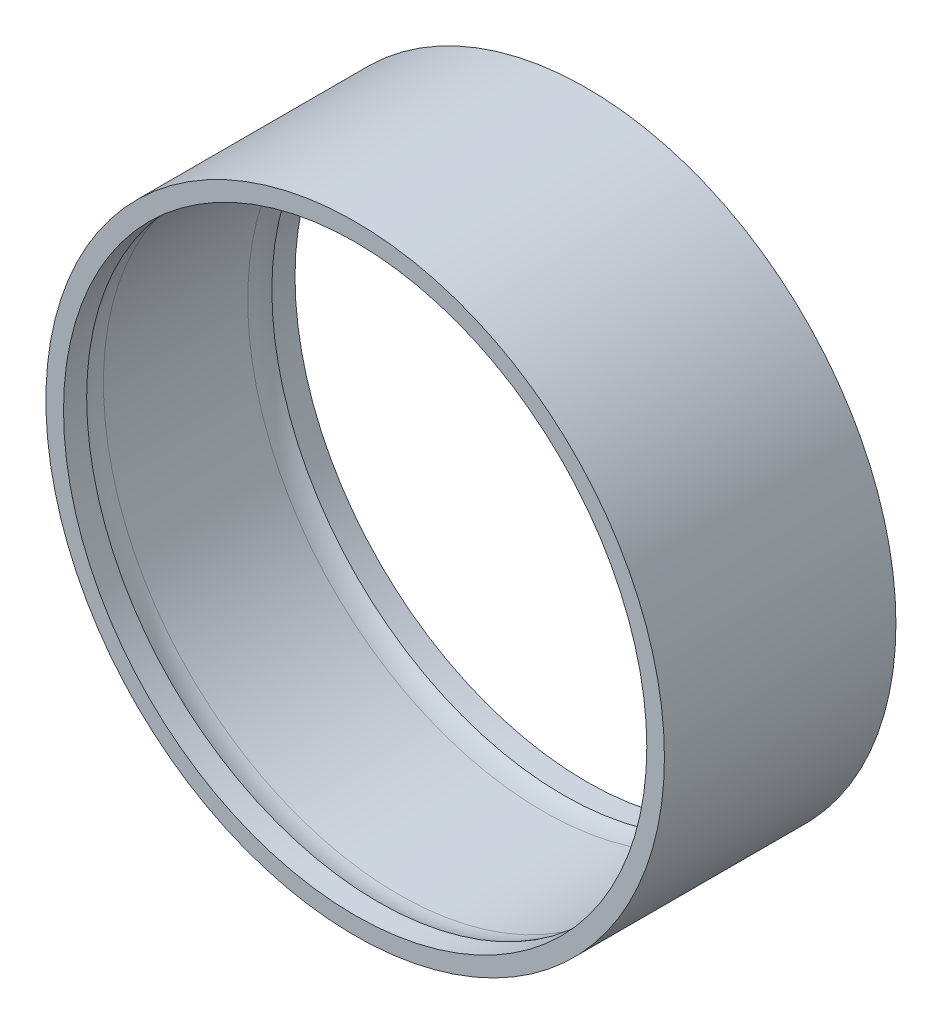
ISO-10303-21;
HEADER;
FILE_DESCRIPTION(('STEP AP214'),'2;1');
FILE_NAME('part.step','',(''),(''),'','','');
FILE_SCHEMA(('AUTOMOTIVE_DESIGN { 1 0 10303 214 1 1 1 1 }'));
ENDSEC;
DATA;
#1=APPLICATION_CONTEXT('core data for automotive mechanical design processes');
#2=APPLICATION_PROTOCOL_DEFINITION('international standard','automotive_design',2000,#1);
#3=PRODUCT_CONTEXT('',#1,'mechanical');
#4=PRODUCT('Part','Part','',(#3));
#5=PRODUCT_RELATED_PRODUCT_CATEGORY('part','',(#4));
#6=PRODUCT_DEFINITION_FORMATION('','',#4);
#7=PRODUCT_DEFINITION_CONTEXT('part definition',#1,'design');
#8=PRODUCT_DEFINITION('design','',#6,#7);
#9=PRODUCT_DEFINITION_SHAPE('','',#8);
#10=(LENGTH_UNIT() NAMED_UNIT(*) SI_UNIT(.MILLI.,.METRE.));
#11=(NAMED_UNIT(*) PLANE_ANGLE_UNIT() SI_UNIT($,.RADIAN.));
#12=(NAMED_UNIT(*) SI_UNIT($,.STERADIAN.) SOLID_ANGLE_UNIT());
#13=UNCERTAINTY_MEASURE_WITH_UNIT(LENGTH_MEASURE(1.E-05),#10,'distance_accuracy_value','');
#14=(GEOMETRIC_REPRESENTATION_CONTEXT(3) GLOBAL_UNCERTAINTY_ASSIGNED_CONTEXT((#13)) GLOBAL_UNIT_ASSIGNED_CONTEXT((#10,
#11,#12)) REPRESENTATION_CONTEXT('',''));
#15=CARTESIAN_POINT('',(0.,0.,0.));
#16=DIRECTION('',(0.,0.,1.));
#17=DIRECTION('',(1.,0.,0.));
#18=AXIS2_PLACEMENT_3D('',#15,#16,#17);
#19=CARTESIAN_POINT('',(0.,0.,15.875));
#20=DIRECTION('',(0.,0.,-1.));
#21=DIRECTION('',(-1.,0.,0.));
#22=AXIS2_PLACEMENT_3D('',#19,#20,#21);
#23=CYLINDRICAL_SURFACE('',#22,40.);
#24=CARTESIAN_POINT('',(0.,0.,15.875));
#25=DIRECTION('',(0.,0.,1.));
#26=DIRECTION('',(1.,0.,0.));
#27=AXIS2_PLACEMENT_3D('',#24,#25,#26);
#28=CIRCLE('',#27,40.);
#29=CARTESIAN_POINT('',(40.,0.,15.875));
#30=VERTEX_POINT('',#29);
#31=EDGE_CURVE('E41',#30,#30,#28,.T.);
#32=ORIENTED_EDGE('',*,*,#31,.T.);
#33=EDGE_LOOP('',(#32));
#34=FACE_BOUND('',#33,.T.);
#35=CARTESIAN_POINT('',(0.,0.,12.7));
#36=DIRECTION('',(0.,0.,1.));
#37=DIRECTION('',(1.,0.,0.));
#38=AXIS2_PLACEMENT_3D('',#35,#36,#37);
#39=CIRCLE('',#38,40.);
#40=CARTESIAN_POINT('',(40.,0.,12.7));
#41=VERTEX_POINT('',#40);
#42=EDGE_CURVE('E46',#41,#41,#39,.T.);
#43=ORIENTED_EDGE('',*,*,#42,.F.);
#44=EDGE_LOOP('',(#43));
#45=FACE_BOUND('',#44,.T.);
#46=ADVANCED_FACE('F30',(#34,#45),#23,.F.);
#47=CARTESIAN_POINT('',(0.,0.,-15.875));
#48=DIRECTION('',(0.,0.,1.));
#49=DIRECTION('',(1.,0.,0.));
#50=AXIS2_PLACEMENT_3D('',#47,#48,#49);
#51=CIRCLE('',#50,40.);
#52=CARTESIAN_POINT('',(40.,0.,-15.875));
#53=VERTEX_POINT('',#52);
#54=EDGE_CURVE('E43',#53,#53,#51,.T.);
#55=ORIENTED_EDGE('',*,*,#54,.F.);
#56=EDGE_LOOP('',(#55));
#57=FACE_BOUND('',#56,.T.);
#58=CARTESIAN_POINT('',(0.,0.,-12.7));
#59=DIRECTION('',(0.,0.,1.));
#60=DIRECTION('',(1.,0.,0.));
#61=AXIS2_PLACEMENT_3D('',#58,#59,#60);
#62=CIRCLE('',#61,40.);
#63=CARTESIAN_POINT('',(40.,0.,-12.7));
#64=VERTEX_POINT('',#63);
#65=EDGE_CURVE('E57',#64,#64,#62,.T.);
#66=ORIENTED_EDGE('',*,*,#65,.T.);
#67=EDGE_LOOP('',(#66));
#68=FACE_BOUND('',#67,.T.);
#69=ADVANCED_FACE('F61',(#57,#68),#23,.F.);
#70=CARTESIAN_POINT('',(0.,0.,15.875));
#71=DIRECTION('',(0.,0.,1.));
#72=DIRECTION('',(1.,0.,0.));
#73=AXIS2_PLACEMENT_3D('',#70,#71,#72);
#74=PLANE('',#73);
#75=CARTESIAN_POINT('',(0.,0.,15.875));
#76=DIRECTION('',(0.,0.,1.));
#77=DIRECTION('',(1.,0.,0.));
#78=AXIS2_PLACEMENT_3D('',#75,#76,#77);
#79=CIRCLE('',#78,42.418);
#80=CARTESIAN_POINT('',(42.418,0.,15.875));
#81=VERTEX_POINT('',#80);
#82=EDGE_CURVE('E10',#81,#81,#79,.T.);
#83=ORIENTED_EDGE('',*,*,#82,.T.);
#84=EDGE_LOOP('',(#83));
#85=FACE_BOUND('',#84,.T.);
#86=ORIENTED_EDGE('',*,*,#31,.F.);
#87=EDGE_LOOP('',(#86));
#88=FACE_BOUND('',#87,.T.);
#89=ADVANCED_FACE('F80',(#85,#88),#74,.T.);
#90=CARTESIAN_POINT('',(0.,0.,-15.875));
#91=DIRECTION('',(0.,0.,1.));
#92=DIRECTION('',(1.,0.,0.));
#93=AXIS2_PLACEMENT_3D('',#90,#91,#92);
#94=PLANE('',#93);
#95=CARTESIAN_POINT('',(0.,0.,-15.875));
#96=DIRECTION('',(0.,0.,1.));
#97=DIRECTION('',(1.,0.,0.));
#98=AXIS2_PLACEMENT_3D('',#95,#96,#97);
#99=CIRCLE('',#98,42.418);
#100=CARTESIAN_POINT('',(42.418,0.,-15.875));
#101=VERTEX_POINT('',#100);
#102=EDGE_CURVE('E34',#101,#101,#99,.T.);
#103=ORIENTED_EDGE('',*,*,#102,.F.);
#104=EDGE_LOOP('',(#103));
#105=FACE_BOUND('',#104,.T.);
#106=ORIENTED_EDGE('',*,*,#54,.T.);
#107=EDGE_LOOP('',(#106));
#108=FACE_BOUND('',#107,.T.);
#109=ADVANCED_FACE('F86',(#105,#108),#94,.F.);
#110=CARTESIAN_POINT('',(0.,0.,15.875));
#111=DIRECTION('',(0.,0.,-1.));
#112=DIRECTION('',(-1.,0.,0.));
#113=AXIS2_PLACEMENT_3D('',#110,#111,#112);
#114=CYLINDRICAL_SURFACE('',#113,42.418);
#115=ORIENTED_EDGE('',*,*,#82,.F.);
#116=EDGE_LOOP('',(#115));
#117=FACE_BOUND('',#116,.T.);
#118=ORIENTED_EDGE('',*,*,#102,.T.);
#119=EDGE_LOOP('',(#118));
#120=FACE_BOUND('',#119,.T.);
#121=ADVANCED_FACE('F32',(#117,#120),#114,.T.);
#122=CARTESIAN_POINT('',(0.,0.,9.89274048224964));
#123=DIRECTION('',(0.,0.,1.));
#124=DIRECTION('',(1.,0.,0.));
#125=AXIS2_PLACEMENT_3D('',#122,#123,#124);
#126=TOROIDAL_SURFACE('',#125,32.5755,7.9375);
#127=ORIENTED_EDGE('',*,*,#42,.T.);
#128=EDGE_LOOP('',(#127));
#129=FACE_BOUND('',#128,.T.);
#130=CARTESIAN_POINT('',(0.,0.,9.89274048224964));
#131=DIRECTION('',(0.,0.,1.));
#132=DIRECTION('',(1.,0.,0.));
#133=AXIS2_PLACEMENT_3D('',#130,#131,#132);
#134=CIRCLE('',#133,40.513);
#135=CARTESIAN_POINT('',(40.513,0.,9.89274048224964));
#136=VERTEX_POINT('',#135);
#137=EDGE_CURVE('E51',#136,#136,#134,.T.);
#138=ORIENTED_EDGE('',*,*,#137,.F.);
#139=EDGE_LOOP('',(#138));
#140=FACE_BOUND('',#139,.T.);
#141=ADVANCED_FACE('F71',(#129,#140),#126,.F.);
#142=CARTESIAN_POINT('',(0.,0.,15.875));
#143=DIRECTION('',(0.,0.,1.));
#144=DIRECTION('',(1.,0.,0.));
#145=AXIS2_PLACEMENT_3D('',#142,#143,#144);
#146=CYLINDRICAL_SURFACE('',#145,40.513);
#147=ORIENTED_EDGE('',*,*,#137,.T.);
#148=EDGE_LOOP('',(#147));
#149=FACE_BOUND('',#148,.T.);
#150=CARTESIAN_POINT('',(0.,0.,-9.89274048224964));
#151=DIRECTION('',(0.,0.,1.));
#152=DIRECTION('',(1.,0.,0.));
#153=AXIS2_PLACEMENT_3D('',#150,#151,#152);
#154=CIRCLE('',#153,40.513);
#155=CARTESIAN_POINT('',(40.513,0.,-9.89274048224964));
#156=VERTEX_POINT('',#155);
#157=EDGE_CURVE('E54',#156,#156,#154,.T.);
#158=ORIENTED_EDGE('',*,*,#157,.F.);
#159=EDGE_LOOP('',(#158));
#160=FACE_BOUND('',#159,.T.);
#161=ADVANCED_FACE('F65',(#149,#160),#146,.F.);
#162=CARTESIAN_POINT('',(0.,0.,-9.89274048224964));
#163=DIRECTION('',(0.,0.,1.));
#164=DIRECTION('',(1.,0.,0.));
#165=AXIS2_PLACEMENT_3D('',#162,#163,#164);
#166=TOROIDAL_SURFACE('',#165,32.5755,7.9375);
#167=ORIENTED_EDGE('',*,*,#157,.T.);
#168=EDGE_LOOP('',(#167));
#169=FACE_BOUND('',#168,.T.);
#170=ORIENTED_EDGE('',*,*,#65,.F.);
#171=EDGE_LOOP('',(#170));
#172=FACE_BOUND('',#171,.T.);
#173=ADVANCED_FACE('F63',(#169,#172),#166,.F.);
#174=CLOSED_SHELL('',(#46,#69,#89,#109,#121,#141,#161,#173));
#175=MANIFOLD_SOLID_BREP('B2',#174);
#176=ADVANCED_BREP_SHAPE_REPRESENTATION('',(#18,#175),#14);
#177=SHAPE_DEFINITION_REPRESENTATION(#9,#176);
ENDSEC;
END-ISO-10303-21;
